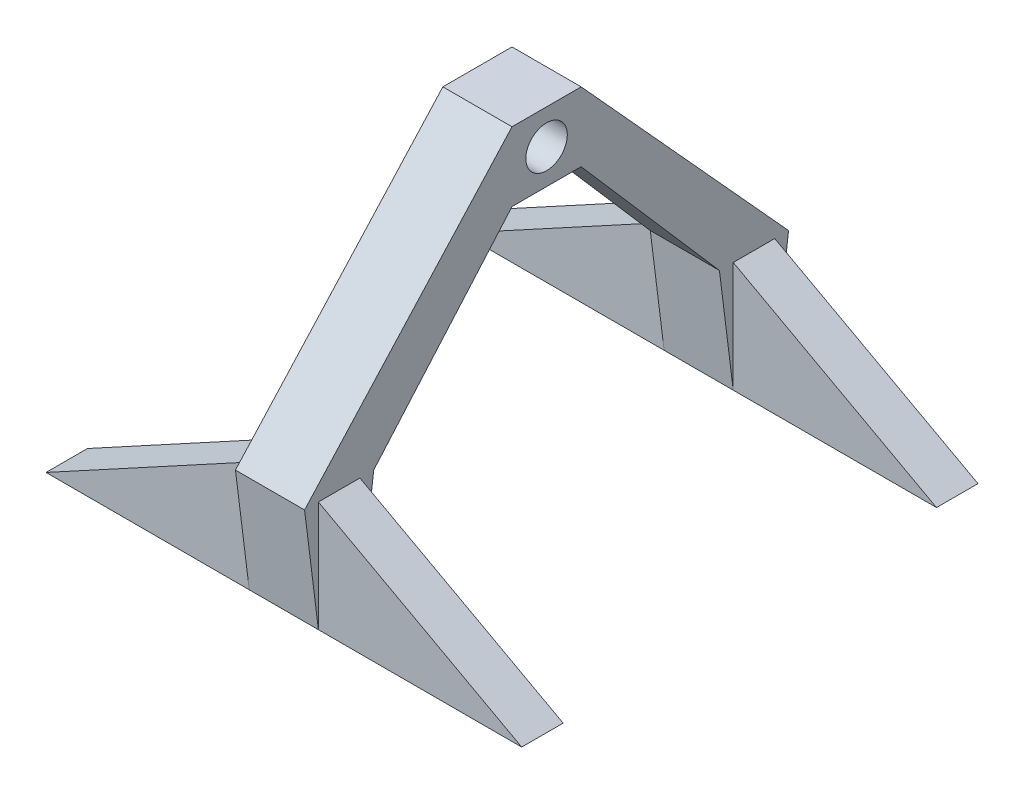
ISO-10303-21;
HEADER;
FILE_DESCRIPTION(('STEP AP214'),'2;1');
FILE_NAME('part.step','',(''),(''),'','','');
FILE_SCHEMA(('AUTOMOTIVE_DESIGN { 1 0 10303 214 1 1 1 1 }'));
ENDSEC;
DATA;
#1=APPLICATION_CONTEXT('core data for automotive mechanical design processes');
#2=APPLICATION_PROTOCOL_DEFINITION('international standard','automotive_design',2000,#1);
#3=PRODUCT_CONTEXT('',#1,'mechanical');
#4=PRODUCT('Part','Part','',(#3));
#5=PRODUCT_RELATED_PRODUCT_CATEGORY('part','',(#4));
#6=PRODUCT_DEFINITION_FORMATION('','',#4);
#7=PRODUCT_DEFINITION_CONTEXT('part definition',#1,'design');
#8=PRODUCT_DEFINITION('design','',#6,#7);
#9=PRODUCT_DEFINITION_SHAPE('','',#8);
#10=(LENGTH_UNIT() NAMED_UNIT(*) SI_UNIT(.MILLI.,.METRE.));
#11=(NAMED_UNIT(*) PLANE_ANGLE_UNIT() SI_UNIT($,.RADIAN.));
#12=(NAMED_UNIT(*) SI_UNIT($,.STERADIAN.) SOLID_ANGLE_UNIT());
#13=UNCERTAINTY_MEASURE_WITH_UNIT(LENGTH_MEASURE(1.E-05),#10,'distance_accuracy_value','');
#14=(GEOMETRIC_REPRESENTATION_CONTEXT(3) GLOBAL_UNCERTAINTY_ASSIGNED_CONTEXT((#13)) GLOBAL_UNIT_ASSIGNED_CONTEXT((#10,
#11,#12)) REPRESENTATION_CONTEXT('',''));
#15=CARTESIAN_POINT('',(0.,0.,0.));
#16=DIRECTION('',(0.,0.,1.));
#17=DIRECTION('',(1.,0.,0.));
#18=AXIS2_PLACEMENT_3D('',#15,#16,#17);
#19=CARTESIAN_POINT('',(0.,0.,0.));
#20=DIRECTION('',(0.,1.,0.));
#21=DIRECTION('',(0.,0.,1.));
#22=AXIS2_PLACEMENT_3D('',#19,#20,#21);
#23=PLANE('',#22);
#24=DIRECTION('',(-1.,0.,0.));
#25=VECTOR('',#24,1.);
#26=CARTESIAN_POINT('',(86.0010000000001,0.,7.5));
#27=LINE('',#26,#25);
#28=CARTESIAN_POINT('',(12.5000000000001,0.,7.5));
#29=VERTEX_POINT('',#28);
#30=CARTESIAN_POINT('',(-12.4999999999999,0.,7.5));
#31=VERTEX_POINT('',#30);
#32=EDGE_CURVE('E317',#29,#31,#27,.T.);
#33=ORIENTED_EDGE('',*,*,#32,.T.);
#34=DIRECTION('',(1.,0.,0.));
#35=VECTOR('',#34,1.);
#36=CARTESIAN_POINT('',(0.,0.,7.5));
#37=LINE('',#36,#35);
#38=CARTESIAN_POINT('',(-85.9999999999999,0.,7.5));
#39=VERTEX_POINT('',#38);
#40=EDGE_CURVE('E333',#39,#31,#37,.T.);
#41=ORIENTED_EDGE('',*,*,#40,.F.);
#42=DIRECTION('',(0.,0.,1.));
#43=VECTOR('',#42,1.);
#44=CARTESIAN_POINT('',(-85.9999999999999,0.,0.));
#45=LINE('',#44,#43);
#46=CARTESIAN_POINT('',(-85.9999999999999,0.,-7.5));
#47=VERTEX_POINT('',#46);
#48=EDGE_CURVE('E349',#47,#39,#45,.T.);
#49=ORIENTED_EDGE('',*,*,#48,.F.);
#50=DIRECTION('',(1.,0.,0.));
#51=VECTOR('',#50,1.);
#52=CARTESIAN_POINT('',(0.,0.,-7.5));
#53=LINE('',#52,#51);
#54=CARTESIAN_POINT('',(-12.4999999999999,0.,-7.5));
#55=VERTEX_POINT('',#54);
#56=EDGE_CURVE('E346',#47,#55,#53,.T.);
#57=ORIENTED_EDGE('',*,*,#56,.T.);
#58=DIRECTION('',(-1.,0.,0.));
#59=VECTOR('',#58,1.);
#60=CARTESIAN_POINT('',(86.0010000000001,0.,-7.5));
#61=LINE('',#60,#59);
#62=CARTESIAN_POINT('',(12.5000000000001,0.,-7.5));
#63=VERTEX_POINT('',#62);
#64=EDGE_CURVE('E326',#63,#55,#61,.T.);
#65=ORIENTED_EDGE('',*,*,#64,.F.);
#66=DIRECTION('',(1.,0.,0.));
#67=VECTOR('',#66,1.);
#68=CARTESIAN_POINT('',(0.,0.,-7.5));
#69=LINE('',#68,#67);
#70=CARTESIAN_POINT('',(85.9999999999999,0.,-7.5));
#71=VERTEX_POINT('',#70);
#72=EDGE_CURVE('E343',#63,#71,#69,.T.);
#73=ORIENTED_EDGE('',*,*,#72,.T.);
#74=DIRECTION('',(0.,0.,1.));
#75=VECTOR('',#74,1.);
#76=CARTESIAN_POINT('',(86.0000000000001,0.,0.));
#77=LINE('',#76,#75);
#78=CARTESIAN_POINT('',(86.0000000000001,0.,7.5));
#79=VERTEX_POINT('',#78);
#80=EDGE_CURVE('E339',#71,#79,#77,.T.);
#81=ORIENTED_EDGE('',*,*,#80,.T.);
#82=DIRECTION('',(1.,0.,0.));
#83=VECTOR('',#82,1.);
#84=CARTESIAN_POINT('',(0.,0.,7.5));
#85=LINE('',#84,#83);
#86=EDGE_CURVE('E336',#29,#79,#85,.T.);
#87=ORIENTED_EDGE('',*,*,#86,.F.);
#88=EDGE_LOOP('',(#33,#41,#49,#57,#65,#73,#81,#87));
#89=FACE_BOUND('',#88,.T.);
#90=ADVANCED_FACE('F35',(#89),#23,.F.);
#91=CARTESIAN_POINT('',(0.,40.,7.5));
#92=DIRECTION('',(0.,0.,-1.));
#93=DIRECTION('',(-1.,0.,0.));
#94=AXIS2_PLACEMENT_3D('',#91,#92,#93);
#95=PLANE('',#94);
#96=DIRECTION('',(-0.87835187550819,0.478014626126906,0.));
#97=VECTOR('',#96,1.);
#98=CARTESIAN_POINT('',(12.4999999999999,40.,7.5));
#99=LINE('',#98,#97);
#100=CARTESIAN_POINT('',(12.5000000000001,40.,7.5));
#101=VERTEX_POINT('',#100);
#102=EDGE_CURVE('E328',#79,#101,#99,.T.);
#103=ORIENTED_EDGE('',*,*,#102,.T.);
#104=DIRECTION('',(0.,-1.,0.));
#105=VECTOR('',#104,1.);
#106=CARTESIAN_POINT('',(12.5000000000001,40.,7.5));
#107=LINE('',#106,#105);
#108=EDGE_CURVE('E11',#101,#29,#107,.T.);
#109=ORIENTED_EDGE('',*,*,#108,.T.);
#110=ORIENTED_EDGE('',*,*,#86,.T.);
#111=EDGE_LOOP('',(#103,#109,#110));
#112=FACE_BOUND('',#111,.T.);
#113=ADVANCED_FACE('F37',(#112),#95,.F.);
#114=CARTESIAN_POINT('',(0.,40.,-7.5));
#115=DIRECTION('',(0.,0.,-1.));
#116=DIRECTION('',(-1.,0.,0.));
#117=AXIS2_PLACEMENT_3D('',#114,#115,#116);
#118=PLANE('',#117);
#119=DIRECTION('',(0.,-1.,0.));
#120=VECTOR('',#119,1.);
#121=CARTESIAN_POINT('',(12.5000000000001,40.,-7.5));
#122=LINE('',#121,#120);
#123=CARTESIAN_POINT('',(12.4999999999999,40.,-7.5));
#124=VERTEX_POINT('',#123);
#125=EDGE_CURVE('E44',#124,#63,#122,.T.);
#126=ORIENTED_EDGE('',*,*,#125,.F.);
#127=DIRECTION('',(0.87835187550819,-0.478014626126906,0.));
#128=VECTOR('',#127,1.);
#129=CARTESIAN_POINT('',(12.4999999999999,40.,-7.5));
#130=LINE('',#129,#128);
#131=EDGE_CURVE('E373',#124,#71,#130,.T.);
#132=ORIENTED_EDGE('',*,*,#131,.T.);
#133=ORIENTED_EDGE('',*,*,#72,.F.);
#134=EDGE_LOOP('',(#126,#132,#133));
#135=FACE_BOUND('',#134,.T.);
#136=ADVANCED_FACE('F425',(#135),#118,.T.);
#137=CARTESIAN_POINT('',(12.5000000000001,40.,0.));
#138=DIRECTION('',(-1.,0.,0.));
#139=DIRECTION('',(0.,0.,1.));
#140=AXIS2_PLACEMENT_3D('',#137,#138,#139);
#141=PLANE('',#140);
#142=DIRECTION('',(0.,-0.739940073395944,-0.672672793996313));
#143=VECTOR('',#142,1.);
#144=CARTESIAN_POINT('',(12.5,122.5,62.5));
#145=LINE('',#144,#143);
#146=CARTESIAN_POINT('',(12.5,122.5,62.5));
#147=VERTEX_POINT('',#146);
#148=CARTESIAN_POINT('',(12.5000000000001,40.,-12.5));
#149=VERTEX_POINT('',#148);
#150=EDGE_CURVE('E310',#147,#149,#145,.T.);
#151=ORIENTED_EDGE('',*,*,#150,.F.);
#152=DIRECTION('',(0.,0.,1.));
#153=VECTOR('',#152,1.);
#154=CARTESIAN_POINT('',(12.5,122.5,62.5));
#155=LINE('',#154,#153);
#156=CARTESIAN_POINT('',(12.5,122.5,87.5));
#157=VERTEX_POINT('',#156);
#158=EDGE_CURVE('E184',#147,#157,#155,.T.);
#159=ORIENTED_EDGE('',*,*,#158,.T.);
#160=DIRECTION('',(0.,-0.739940073395944,0.672672793996313));
#161=VECTOR('',#160,1.);
#162=CARTESIAN_POINT('',(12.5,122.5,87.5));
#163=LINE('',#162,#161);
#164=CARTESIAN_POINT('',(12.5000000000001,40.,162.5));
#165=VERTEX_POINT('',#164);
#166=EDGE_CURVE('E195',#157,#165,#163,.T.);
#167=ORIENTED_EDGE('',*,*,#166,.T.);
#168=DIRECTION('',(0.,-0.992277876713668,-0.124034734589209));
#169=VECTOR('',#168,1.);
#170=CARTESIAN_POINT('',(12.5000000000001,40.,162.5));
#171=LINE('',#170,#169);
#172=CARTESIAN_POINT('',(12.5000000000001,0.,157.5));
#173=VERTEX_POINT('',#172);
#174=EDGE_CURVE('E218',#165,#173,#171,.T.);
#175=ORIENTED_EDGE('',*,*,#174,.T.);
#176=DIRECTION('',(0.,-1.,0.));
#177=VECTOR('',#176,1.);
#178=CARTESIAN_POINT('',(12.5000000000001,40.,157.5));
#179=LINE('',#178,#177);
#180=CARTESIAN_POINT('',(12.4999999999999,40.,157.5));
#181=VERTEX_POINT('',#180);
#182=EDGE_CURVE('E269',#181,#173,#179,.T.);
#183=ORIENTED_EDGE('',*,*,#182,.F.);
#184=DIRECTION('',(0.,0.,1.));
#185=VECTOR('',#184,1.);
#186=CARTESIAN_POINT('',(12.4999999999999,40.,137.499));
#187=LINE('',#186,#185);
#188=CARTESIAN_POINT('',(12.5000000000001,40.,142.5));
#189=VERTEX_POINT('',#188);
#190=EDGE_CURVE('E265',#189,#181,#187,.T.);
#191=ORIENTED_EDGE('',*,*,#190,.F.);
#192=DIRECTION('',(0.,-1.,0.));
#193=VECTOR('',#192,1.);
#194=CARTESIAN_POINT('',(12.5000000000001,40.,142.5));
#195=LINE('',#194,#193);
#196=CARTESIAN_POINT('',(12.5000000000001,0.,142.5));
#197=VERTEX_POINT('',#196);
#198=EDGE_CURVE('E281',#189,#197,#195,.T.);
#199=ORIENTED_EDGE('',*,*,#198,.T.);
#200=DIRECTION('',(0.,-0.992277876713668,0.124034734589209));
#201=VECTOR('',#200,1.);
#202=CARTESIAN_POINT('',(12.5000000000001,40.,137.5));
#203=LINE('',#202,#201);
#204=CARTESIAN_POINT('',(12.5,40.,137.5));
#205=VERTEX_POINT('',#204);
#206=EDGE_CURVE('E201',#205,#197,#203,.T.);
#207=ORIENTED_EDGE('',*,*,#206,.F.);
#208=DIRECTION('',(0.,0.754605522163505,-0.656178714924787));
#209=VECTOR('',#208,1.);
#210=CARTESIAN_POINT('',(12.5,97.5,87.5));
#211=LINE('',#210,#209);
#212=CARTESIAN_POINT('',(12.5,97.5,87.5));
#213=VERTEX_POINT('',#212);
#214=EDGE_CURVE('E191',#205,#213,#211,.T.);
#215=ORIENTED_EDGE('',*,*,#214,.T.);
#216=DIRECTION('',(0.,0.,-1.));
#217=VECTOR('',#216,1.);
#218=CARTESIAN_POINT('',(12.5,97.5,62.5));
#219=LINE('',#218,#217);
#220=CARTESIAN_POINT('',(12.5,97.5,62.5));
#221=VERTEX_POINT('',#220);
#222=EDGE_CURVE('E173',#213,#221,#219,.T.);
#223=ORIENTED_EDGE('',*,*,#222,.T.);
#224=DIRECTION('',(0.,0.754605522163505,0.656178714924787));
#225=VECTOR('',#224,1.);
#226=CARTESIAN_POINT('',(12.5,97.5,62.5));
#227=LINE('',#226,#225);
#228=CARTESIAN_POINT('',(12.5,40.,12.5));
#229=VERTEX_POINT('',#228);
#230=EDGE_CURVE('E308',#229,#221,#227,.T.);
#231=ORIENTED_EDGE('',*,*,#230,.F.);
#232=DIRECTION('',(0.,-0.992277876713668,-0.124034734589209));
#233=VECTOR('',#232,1.);
#234=CARTESIAN_POINT('',(12.5000000000001,40.,12.5));
#235=LINE('',#234,#233);
#236=EDGE_CURVE('E319',#229,#29,#235,.T.);
#237=ORIENTED_EDGE('',*,*,#236,.T.);
#238=ORIENTED_EDGE('',*,*,#108,.F.);
#239=DIRECTION('',(0.,0.,-1.));
#240=VECTOR('',#239,1.);
#241=CARTESIAN_POINT('',(12.4999999999999,40.,12.501));
#242=LINE('',#241,#240);
#243=EDGE_CURVE('E366',#101,#124,#242,.T.);
#244=ORIENTED_EDGE('',*,*,#243,.T.);
#245=ORIENTED_EDGE('',*,*,#125,.T.);
#246=DIRECTION('',(0.,-0.992277876713668,0.124034734589209));
#247=VECTOR('',#246,1.);
#248=CARTESIAN_POINT('',(12.5000000000001,40.,-12.5));
#249=LINE('',#248,#247);
#250=EDGE_CURVE('E322',#149,#63,#249,.T.);
#251=ORIENTED_EDGE('',*,*,#250,.F.);
#252=EDGE_LOOP('',(#151,#159,#167,#175,#183,#191,#199,#207,#215,#223,#231,#237,#238,#244,#245,#251));
#253=FACE_BOUND('',#252,.T.);
#254=CARTESIAN_POINT('',(12.5,110.,75.));
#255=DIRECTION('',(1.,0.,0.));
#256=DIRECTION('',(0.,0.,-1.));
#257=AXIS2_PLACEMENT_3D('',#254,#255,#256);
#258=CIRCLE('',#257,7.50000000000001);
#259=CARTESIAN_POINT('',(12.5,110.,67.5));
#260=VERTEX_POINT('',#259);
#261=EDGE_CURVE('E185',#260,#260,#258,.T.);
#262=ORIENTED_EDGE('',*,*,#261,.F.);
#263=EDGE_LOOP('',(#262));
#264=FACE_BOUND('',#263,.T.);
#265=ADVANCED_FACE('F198',(#253,#264),#141,.F.);
#266=CARTESIAN_POINT('',(-12.4999999999999,40.,0.));
#267=DIRECTION('',(-1.,0.,0.));
#268=DIRECTION('',(0.,0.,1.));
#269=AXIS2_PLACEMENT_3D('',#266,#267,#268);
#270=PLANE('',#269);
#271=DIRECTION('',(0.,-0.754605522163505,-0.656178714924787));
#272=VECTOR('',#271,1.);
#273=CARTESIAN_POINT('',(-12.5,97.5,62.5));
#274=LINE('',#273,#272);
#275=CARTESIAN_POINT('',(-12.5,97.5,62.5));
#276=VERTEX_POINT('',#275);
#277=CARTESIAN_POINT('',(-12.4999999999999,40.,12.5));
#278=VERTEX_POINT('',#277);
#279=EDGE_CURVE('E302',#276,#278,#274,.T.);
#280=ORIENTED_EDGE('',*,*,#279,.F.);
#281=DIRECTION('',(0.,0.,-1.));
#282=VECTOR('',#281,1.);
#283=CARTESIAN_POINT('',(-12.5,97.5,62.5));
#284=LINE('',#283,#282);
#285=CARTESIAN_POINT('',(-12.5,97.5,87.5));
#286=VERTEX_POINT('',#285);
#287=EDGE_CURVE('E298',#286,#276,#284,.T.);
#288=ORIENTED_EDGE('',*,*,#287,.F.);
#289=DIRECTION('',(0.,-0.754605522163505,0.656178714924787));
#290=VECTOR('',#289,1.);
#291=CARTESIAN_POINT('',(-12.5,97.5,87.5));
#292=LINE('',#291,#290);
#293=CARTESIAN_POINT('',(-12.4999999999999,40.,137.5));
#294=VERTEX_POINT('',#293);
#295=EDGE_CURVE('E194',#286,#294,#292,.T.);
#296=ORIENTED_EDGE('',*,*,#295,.T.);
#297=DIRECTION('',(0.,0.992277876713668,-0.124034734589209));
#298=VECTOR('',#297,1.);
#299=CARTESIAN_POINT('',(-12.4999999999999,40.,137.5));
#300=LINE('',#299,#298);
#301=CARTESIAN_POINT('',(-12.4999999999999,0.,142.5));
#302=VERTEX_POINT('',#301);
#303=EDGE_CURVE('E202',#302,#294,#300,.T.);
#304=ORIENTED_EDGE('',*,*,#303,.F.);
#305=DIRECTION('',(0.,-1.,0.));
#306=VECTOR('',#305,1.);
#307=CARTESIAN_POINT('',(-12.4999999999999,40.,142.5));
#308=LINE('',#307,#306);
#309=CARTESIAN_POINT('',(-12.4999999999999,40.,142.5));
#310=VERTEX_POINT('',#309);
#311=EDGE_CURVE('E232',#310,#302,#308,.T.);
#312=ORIENTED_EDGE('',*,*,#311,.F.);
#313=DIRECTION('',(0.,0.,1.));
#314=VECTOR('',#313,1.);
#315=CARTESIAN_POINT('',(-12.4999999999999,40.,137.499));
#316=LINE('',#315,#314);
#317=CARTESIAN_POINT('',(-12.4999999999999,40.,157.5));
#318=VERTEX_POINT('',#317);
#319=EDGE_CURVE('E252',#310,#318,#316,.T.);
#320=ORIENTED_EDGE('',*,*,#319,.T.);
#321=DIRECTION('',(0.,-1.,0.));
#322=VECTOR('',#321,1.);
#323=CARTESIAN_POINT('',(-12.4999999999999,40.,157.5));
#324=LINE('',#323,#322);
#325=CARTESIAN_POINT('',(-12.4999999999999,0.,157.5));
#326=VERTEX_POINT('',#325);
#327=EDGE_CURVE('E261',#318,#326,#324,.T.);
#328=ORIENTED_EDGE('',*,*,#327,.T.);
#329=DIRECTION('',(0.,0.992277876713668,0.124034734589209));
#330=VECTOR('',#329,1.);
#331=CARTESIAN_POINT('',(-12.4999999999999,40.,162.5));
#332=LINE('',#331,#330);
#333=CARTESIAN_POINT('',(-12.4999999999999,40.,162.5));
#334=VERTEX_POINT('',#333);
#335=EDGE_CURVE('E220',#326,#334,#332,.T.);
#336=ORIENTED_EDGE('',*,*,#335,.T.);
#337=DIRECTION('',(0.,0.739940073395944,-0.672672793996313));
#338=VECTOR('',#337,1.);
#339=CARTESIAN_POINT('',(-12.5,122.5,87.5));
#340=LINE('',#339,#338);
#341=CARTESIAN_POINT('',(-12.5,122.5,87.5));
#342=VERTEX_POINT('',#341);
#343=EDGE_CURVE('E211',#334,#342,#340,.T.);
#344=ORIENTED_EDGE('',*,*,#343,.T.);
#345=DIRECTION('',(0.,0.,1.));
#346=VECTOR('',#345,1.);
#347=CARTESIAN_POINT('',(-12.5,122.5,62.5));
#348=LINE('',#347,#346);
#349=CARTESIAN_POINT('',(-12.5,122.5,62.5));
#350=VERTEX_POINT('',#349);
#351=EDGE_CURVE('E300',#350,#342,#348,.T.);
#352=ORIENTED_EDGE('',*,*,#351,.F.);
#353=DIRECTION('',(0.,0.739940073395944,0.672672793996313));
#354=VECTOR('',#353,1.);
#355=CARTESIAN_POINT('',(-12.5,122.5,62.5));
#356=LINE('',#355,#354);
#357=CARTESIAN_POINT('',(-12.4999999999999,40.,-12.5));
#358=VERTEX_POINT('',#357);
#359=EDGE_CURVE('E305',#358,#350,#356,.T.);
#360=ORIENTED_EDGE('',*,*,#359,.F.);
#361=DIRECTION('',(0.,0.992277876713668,-0.124034734589209));
#362=VECTOR('',#361,1.);
#363=CARTESIAN_POINT('',(-12.4999999999999,40.,-12.5));
#364=LINE('',#363,#362);
#365=EDGE_CURVE('E324',#55,#358,#364,.T.);
#366=ORIENTED_EDGE('',*,*,#365,.F.);
#367=DIRECTION('',(0.,-1.,0.));
#368=VECTOR('',#367,1.);
#369=CARTESIAN_POINT('',(-12.4999999999999,40.,-7.5));
#370=LINE('',#369,#368);
#371=CARTESIAN_POINT('',(-12.4999999999999,40.,-7.5));
#372=VERTEX_POINT('',#371);
#373=EDGE_CURVE('E362',#372,#55,#370,.T.);
#374=ORIENTED_EDGE('',*,*,#373,.F.);
#375=DIRECTION('',(0.,0.,-1.));
#376=VECTOR('',#375,1.);
#377=CARTESIAN_POINT('',(-12.4999999999999,40.,12.501));
#378=LINE('',#377,#376);
#379=CARTESIAN_POINT('',(-12.4999999999999,40.,7.5));
#380=VERTEX_POINT('',#379);
#381=EDGE_CURVE('E354',#380,#372,#378,.T.);
#382=ORIENTED_EDGE('',*,*,#381,.F.);
#383=DIRECTION('',(0.,-1.,0.));
#384=VECTOR('',#383,1.);
#385=CARTESIAN_POINT('',(-12.4999999999999,40.,7.5));
#386=LINE('',#385,#384);
#387=EDGE_CURVE('E335',#380,#31,#386,.T.);
#388=ORIENTED_EDGE('',*,*,#387,.T.);
#389=DIRECTION('',(0.,0.992277876713668,0.124034734589209));
#390=VECTOR('',#389,1.);
#391=CARTESIAN_POINT('',(-12.4999999999999,40.,12.5));
#392=LINE('',#391,#390);
#393=EDGE_CURVE('E51',#31,#278,#392,.T.);
#394=ORIENTED_EDGE('',*,*,#393,.T.);
#395=EDGE_LOOP('',(#280,#288,#296,#304,#312,#320,#328,#336,#344,#352,#360,#366,#374,#382,#388,#394));
#396=FACE_BOUND('',#395,.T.);
#397=CARTESIAN_POINT('',(-12.5,110.,75.));
#398=DIRECTION('',(1.,0.,0.));
#399=DIRECTION('',(0.,0.,-1.));
#400=AXIS2_PLACEMENT_3D('',#397,#398,#399);
#401=CIRCLE('',#400,7.50000000000001);
#402=CARTESIAN_POINT('',(-12.5,110.,67.5));
#403=VERTEX_POINT('',#402);
#404=EDGE_CURVE('E295',#403,#403,#401,.T.);
#405=ORIENTED_EDGE('',*,*,#404,.T.);
#406=EDGE_LOOP('',(#405));
#407=FACE_BOUND('',#406,.T.);
#408=ADVANCED_FACE('F399',(#396,#407),#270,.T.);
#409=CARTESIAN_POINT('',(0.,40.,-7.5));
#410=DIRECTION('',(0.,0.,-1.));
#411=DIRECTION('',(-1.,0.,0.));
#412=AXIS2_PLACEMENT_3D('',#409,#410,#411);
#413=PLANE('',#412);
#414=DIRECTION('',(-0.87835187550819,-0.478014626126906,0.));
#415=VECTOR('',#414,1.);
#416=CARTESIAN_POINT('',(-12.4999999999999,40.,-7.5));
#417=LINE('',#416,#415);
#418=EDGE_CURVE('E59',#372,#47,#417,.T.);
#419=ORIENTED_EDGE('',*,*,#418,.F.);
#420=ORIENTED_EDGE('',*,*,#373,.T.);
#421=ORIENTED_EDGE('',*,*,#56,.F.);
#422=EDGE_LOOP('',(#419,#420,#421));
#423=FACE_BOUND('',#422,.T.);
#424=ADVANCED_FACE('F409',(#423),#413,.T.);
#425=CARTESIAN_POINT('',(0.,40.,7.5));
#426=DIRECTION('',(0.,0.,-1.));
#427=DIRECTION('',(-1.,0.,0.));
#428=AXIS2_PLACEMENT_3D('',#425,#426,#427);
#429=PLANE('',#428);
#430=ORIENTED_EDGE('',*,*,#387,.F.);
#431=DIRECTION('',(0.87835187550819,0.478014626126906,0.));
#432=VECTOR('',#431,1.);
#433=CARTESIAN_POINT('',(-12.4999999999999,40.,7.5));
#434=LINE('',#433,#432);
#435=EDGE_CURVE('E340',#39,#380,#434,.T.);
#436=ORIENTED_EDGE('',*,*,#435,.F.);
#437=ORIENTED_EDGE('',*,*,#40,.T.);
#438=EDGE_LOOP('',(#430,#436,#437));
#439=FACE_BOUND('',#438,.T.);
#440=ADVANCED_FACE('F404',(#439),#429,.F.);
#441=CARTESIAN_POINT('',(-12.4999999999999,40.,12.501));
#442=DIRECTION('',(0.478014626126906,-0.878351875508189,0.));
#443=DIRECTION('',(0.87835187550819,0.478014626126906,0.));
#444=AXIS2_PLACEMENT_3D('',#441,#442,#443);
#445=PLANE('',#444);
#446=ORIENTED_EDGE('',*,*,#435,.T.);
#447=ORIENTED_EDGE('',*,*,#381,.T.);
#448=ORIENTED_EDGE('',*,*,#418,.T.);
#449=ORIENTED_EDGE('',*,*,#48,.T.);
#450=EDGE_LOOP('',(#446,#447,#448,#449));
#451=FACE_BOUND('',#450,.T.);
#452=ADVANCED_FACE('F405',(#451),#445,.F.);
#453=CARTESIAN_POINT('',(12.4999999999999,40.,12.501));
#454=DIRECTION('',(0.478014626126906,0.878351875508189,0.));
#455=DIRECTION('',(-0.87835187550819,0.478014626126906,0.));
#456=AXIS2_PLACEMENT_3D('',#453,#454,#455);
#457=PLANE('',#456);
#458=ORIENTED_EDGE('',*,*,#80,.F.);
#459=ORIENTED_EDGE('',*,*,#131,.F.);
#460=ORIENTED_EDGE('',*,*,#243,.F.);
#461=ORIENTED_EDGE('',*,*,#102,.F.);
#462=EDGE_LOOP('',(#458,#459,#460,#461));
#463=FACE_BOUND('',#462,.T.);
#464=ADVANCED_FACE('F426',(#463),#457,.T.);
#465=CARTESIAN_POINT('',(86.0010000000001,40.,-12.5));
#466=DIRECTION('',(0.,0.124034734589209,0.992277876713668));
#467=DIRECTION('',(0.,-0.992277876713668,0.124034734589209));
#468=AXIS2_PLACEMENT_3D('',#465,#466,#467);
#469=PLANE('',#468);
#470=ORIENTED_EDGE('',*,*,#250,.T.);
#471=ORIENTED_EDGE('',*,*,#64,.T.);
#472=ORIENTED_EDGE('',*,*,#365,.T.);
#473=DIRECTION('',(1.,0.,0.));
#474=VECTOR('',#473,1.);
#475=CARTESIAN_POINT('',(0.,40.,-12.5));
#476=LINE('',#475,#474);
#477=EDGE_CURVE('E332',#358,#149,#476,.T.);
#478=ORIENTED_EDGE('',*,*,#477,.T.);
#479=EDGE_LOOP('',(#470,#471,#472,#478));
#480=FACE_BOUND('',#479,.T.);
#481=ADVANCED_FACE('F415',(#480),#469,.F.);
#482=CARTESIAN_POINT('',(86.0010000000001,40.,12.5));
#483=DIRECTION('',(0.,-0.124034734589209,0.992277876713668));
#484=DIRECTION('',(0.,-0.992277876713668,-0.124034734589209));
#485=AXIS2_PLACEMENT_3D('',#482,#483,#484);
#486=PLANE('',#485);
#487=DIRECTION('',(1.,0.,0.));
#488=VECTOR('',#487,1.);
#489=CARTESIAN_POINT('',(0.,40.,12.5));
#490=LINE('',#489,#488);
#491=EDGE_CURVE('E329',#278,#229,#490,.T.);
#492=ORIENTED_EDGE('',*,*,#491,.F.);
#493=ORIENTED_EDGE('',*,*,#393,.F.);
#494=ORIENTED_EDGE('',*,*,#32,.F.);
#495=ORIENTED_EDGE('',*,*,#236,.F.);
#496=EDGE_LOOP('',(#492,#493,#494,#495));
#497=FACE_BOUND('',#496,.T.);
#498=ADVANCED_FACE('F393',(#497),#486,.T.);
#499=CARTESIAN_POINT('',(123.995515604889,122.5,62.5));
#500=DIRECTION('',(0.,-0.672672793996313,0.739940073395944));
#501=DIRECTION('',(0.,-0.739940073395944,-0.672672793996313));
#502=AXIS2_PLACEMENT_3D('',#499,#500,#501);
#503=PLANE('',#502);
#504=DIRECTION('',(-1.,0.,0.));
#505=VECTOR('',#504,1.);
#506=CARTESIAN_POINT('',(123.995515604889,122.5,62.5));
#507=LINE('',#506,#505);
#508=EDGE_CURVE('E307',#147,#350,#507,.T.);
#509=ORIENTED_EDGE('',*,*,#508,.F.);
#510=ORIENTED_EDGE('',*,*,#150,.T.);
#511=ORIENTED_EDGE('',*,*,#477,.F.);
#512=ORIENTED_EDGE('',*,*,#359,.T.);
#513=EDGE_LOOP('',(#509,#510,#511,#512));
#514=FACE_BOUND('',#513,.T.);
#515=ADVANCED_FACE('F419',(#514),#503,.F.);
#516=CARTESIAN_POINT('',(123.995515604889,97.5,62.5));
#517=DIRECTION('',(0.,0.656178714924787,-0.754605522163505));
#518=DIRECTION('',(0.,0.754605522163505,0.656178714924787));
#519=AXIS2_PLACEMENT_3D('',#516,#517,#518);
#520=PLANE('',#519);
#521=ORIENTED_EDGE('',*,*,#491,.T.);
#522=ORIENTED_EDGE('',*,*,#230,.T.);
#523=DIRECTION('',(-1.,0.,0.));
#524=VECTOR('',#523,1.);
#525=CARTESIAN_POINT('',(123.995515604889,97.5,62.5));
#526=LINE('',#525,#524);
#527=EDGE_CURVE('E180',#221,#276,#526,.T.);
#528=ORIENTED_EDGE('',*,*,#527,.T.);
#529=ORIENTED_EDGE('',*,*,#279,.T.);
#530=EDGE_LOOP('',(#521,#522,#528,#529));
#531=FACE_BOUND('',#530,.T.);
#532=ADVANCED_FACE('F520',(#531),#520,.F.);
#533=CARTESIAN_POINT('',(-12.5,122.5,62.5));
#534=DIRECTION('',(0.,1.,0.));
#535=DIRECTION('',(0.,0.,1.));
#536=AXIS2_PLACEMENT_3D('',#533,#534,#535);
#537=PLANE('',#536);
#538=DIRECTION('',(-1.,0.,0.));
#539=VECTOR('',#538,1.);
#540=CARTESIAN_POINT('',(123.995515604889,122.5,87.5));
#541=LINE('',#540,#539);
#542=EDGE_CURVE('E196',#157,#342,#541,.T.);
#543=ORIENTED_EDGE('',*,*,#542,.F.);
#544=ORIENTED_EDGE('',*,*,#158,.F.);
#545=ORIENTED_EDGE('',*,*,#508,.T.);
#546=ORIENTED_EDGE('',*,*,#351,.T.);
#547=EDGE_LOOP('',(#543,#544,#545,#546));
#548=FACE_BOUND('',#547,.T.);
#549=ADVANCED_FACE('F527',(#548),#537,.T.);
#550=CARTESIAN_POINT('',(-12.5,97.5,62.5));
#551=DIRECTION('',(0.,-1.,0.));
#552=DIRECTION('',(0.,0.,-1.));
#553=AXIS2_PLACEMENT_3D('',#550,#551,#552);
#554=PLANE('',#553);
#555=ORIENTED_EDGE('',*,*,#527,.F.);
#556=ORIENTED_EDGE('',*,*,#222,.F.);
#557=DIRECTION('',(-1.,0.,0.));
#558=VECTOR('',#557,1.);
#559=CARTESIAN_POINT('',(123.995515604889,97.5,87.5));
#560=LINE('',#559,#558);
#561=EDGE_CURVE('E177',#213,#286,#560,.T.);
#562=ORIENTED_EDGE('',*,*,#561,.T.);
#563=ORIENTED_EDGE('',*,*,#287,.T.);
#564=EDGE_LOOP('',(#555,#556,#562,#563));
#565=FACE_BOUND('',#564,.T.);
#566=ADVANCED_FACE('F175',(#565),#554,.T.);
#567=CARTESIAN_POINT('',(-12.5,110.,75.));
#568=DIRECTION('',(1.,0.,0.));
#569=DIRECTION('',(0.,0.,-1.));
#570=AXIS2_PLACEMENT_3D('',#567,#568,#569);
#571=CYLINDRICAL_SURFACE('',#570,7.50000000000001);
#572=ORIENTED_EDGE('',*,*,#404,.F.);
#573=EDGE_LOOP('',(#572));
#574=FACE_BOUND('',#573,.T.);
#575=ORIENTED_EDGE('',*,*,#261,.T.);
#576=EDGE_LOOP('',(#575));
#577=FACE_BOUND('',#576,.T.);
#578=ADVANCED_FACE('F533',(#574,#577),#571,.F.);
#579=CARTESIAN_POINT('',(0.,0.,150.));
#580=DIRECTION('',(0.,1.,0.));
#581=DIRECTION('',(0.,0.,-1.));
#582=AXIS2_PLACEMENT_3D('',#579,#580,#581);
#583=PLANE('',#582);
#584=DIRECTION('',(-1.,0.,0.));
#585=VECTOR('',#584,1.);
#586=CARTESIAN_POINT('',(86.0010000000001,0.,142.5));
#587=LINE('',#586,#585);
#588=EDGE_CURVE('E205',#197,#302,#587,.T.);
#589=ORIENTED_EDGE('',*,*,#588,.F.);
#590=DIRECTION('',(1.,0.,0.));
#591=VECTOR('',#590,1.);
#592=CARTESIAN_POINT('',(0.,0.,142.5));
#593=LINE('',#592,#591);
#594=CARTESIAN_POINT('',(86.0000000000001,0.,142.5));
#595=VERTEX_POINT('',#594);
#596=EDGE_CURVE('E233',#197,#595,#593,.T.);
#597=ORIENTED_EDGE('',*,*,#596,.T.);
#598=DIRECTION('',(0.,0.,-1.));
#599=VECTOR('',#598,1.);
#600=CARTESIAN_POINT('',(86.0000000000001,0.,150.));
#601=LINE('',#600,#599);
#602=CARTESIAN_POINT('',(85.9999999999999,0.,157.5));
#603=VERTEX_POINT('',#602);
#604=EDGE_CURVE('E236',#603,#595,#601,.T.);
#605=ORIENTED_EDGE('',*,*,#604,.F.);
#606=DIRECTION('',(1.,0.,0.));
#607=VECTOR('',#606,1.);
#608=CARTESIAN_POINT('',(0.,0.,157.5));
#609=LINE('',#608,#607);
#610=EDGE_CURVE('E240',#173,#603,#609,.T.);
#611=ORIENTED_EDGE('',*,*,#610,.F.);
#612=DIRECTION('',(-1.,0.,0.));
#613=VECTOR('',#612,1.);
#614=CARTESIAN_POINT('',(86.0010000000001,0.,157.5));
#615=LINE('',#614,#613);
#616=EDGE_CURVE('E223',#173,#326,#615,.T.);
#617=ORIENTED_EDGE('',*,*,#616,.T.);
#618=DIRECTION('',(1.,0.,0.));
#619=VECTOR('',#618,1.);
#620=CARTESIAN_POINT('',(0.,0.,157.5));
#621=LINE('',#620,#619);
#622=CARTESIAN_POINT('',(-85.9999999999999,0.,157.5));
#623=VERTEX_POINT('',#622);
#624=EDGE_CURVE('E243',#623,#326,#621,.T.);
#625=ORIENTED_EDGE('',*,*,#624,.F.);
#626=DIRECTION('',(0.,0.,-1.));
#627=VECTOR('',#626,1.);
#628=CARTESIAN_POINT('',(-85.9999999999999,0.,150.));
#629=LINE('',#628,#627);
#630=CARTESIAN_POINT('',(-85.9999999999999,0.,142.5));
#631=VERTEX_POINT('',#630);
#632=EDGE_CURVE('E246',#623,#631,#629,.T.);
#633=ORIENTED_EDGE('',*,*,#632,.T.);
#634=DIRECTION('',(1.,0.,0.));
#635=VECTOR('',#634,1.);
#636=CARTESIAN_POINT('',(0.,0.,142.5));
#637=LINE('',#636,#635);
#638=EDGE_CURVE('E230',#631,#302,#637,.T.);
#639=ORIENTED_EDGE('',*,*,#638,.T.);
#640=EDGE_LOOP('',(#589,#597,#605,#611,#617,#625,#633,#639));
#641=FACE_BOUND('',#640,.T.);
#642=ADVANCED_FACE('F537',(#641),#583,.F.);
#643=CARTESIAN_POINT('',(0.,40.,142.5));
#644=DIRECTION('',(0.,0.,1.));
#645=DIRECTION('',(-1.,0.,0.));
#646=AXIS2_PLACEMENT_3D('',#643,#644,#645);
#647=PLANE('',#646);
#648=DIRECTION('',(-0.87835187550819,0.478014626126906,0.));
#649=VECTOR('',#648,1.);
#650=CARTESIAN_POINT('',(12.4999999999999,40.,142.5));
#651=LINE('',#650,#649);
#652=EDGE_CURVE('E226',#595,#189,#651,.T.);
#653=ORIENTED_EDGE('',*,*,#652,.F.);
#654=ORIENTED_EDGE('',*,*,#596,.F.);
#655=ORIENTED_EDGE('',*,*,#198,.F.);
#656=EDGE_LOOP('',(#653,#654,#655));
#657=FACE_BOUND('',#656,.T.);
#658=ADVANCED_FACE('F583',(#657),#647,.F.);
#659=CARTESIAN_POINT('',(0.,40.,157.5));
#660=DIRECTION('',(0.,0.,1.));
#661=DIRECTION('',(-1.,0.,0.));
#662=AXIS2_PLACEMENT_3D('',#659,#660,#661);
#663=PLANE('',#662);
#664=ORIENTED_EDGE('',*,*,#182,.T.);
#665=ORIENTED_EDGE('',*,*,#610,.T.);
#666=DIRECTION('',(0.87835187550819,-0.478014626126906,0.));
#667=VECTOR('',#666,1.);
#668=CARTESIAN_POINT('',(12.4999999999999,40.,157.5));
#669=LINE('',#668,#667);
#670=EDGE_CURVE('E272',#181,#603,#669,.T.);
#671=ORIENTED_EDGE('',*,*,#670,.F.);
#672=EDGE_LOOP('',(#664,#665,#671));
#673=FACE_BOUND('',#672,.T.);
#674=ADVANCED_FACE('F602',(#673),#663,.T.);
#675=CARTESIAN_POINT('',(0.,40.,157.5));
#676=DIRECTION('',(0.,0.,1.));
#677=DIRECTION('',(-1.,0.,0.));
#678=AXIS2_PLACEMENT_3D('',#675,#676,#677);
#679=PLANE('',#678);
#680=DIRECTION('',(-0.87835187550819,-0.478014626126906,0.));
#681=VECTOR('',#680,1.);
#682=CARTESIAN_POINT('',(-12.4999999999999,40.,157.5));
#683=LINE('',#682,#681);
#684=EDGE_CURVE('E257',#318,#623,#683,.T.);
#685=ORIENTED_EDGE('',*,*,#684,.T.);
#686=ORIENTED_EDGE('',*,*,#624,.T.);
#687=ORIENTED_EDGE('',*,*,#327,.F.);
#688=EDGE_LOOP('',(#685,#686,#687));
#689=FACE_BOUND('',#688,.T.);
#690=ADVANCED_FACE('F611',(#689),#679,.T.);
#691=CARTESIAN_POINT('',(0.,40.,142.5));
#692=DIRECTION('',(0.,0.,1.));
#693=DIRECTION('',(-1.,0.,0.));
#694=AXIS2_PLACEMENT_3D('',#691,#692,#693);
#695=PLANE('',#694);
#696=ORIENTED_EDGE('',*,*,#311,.T.);
#697=ORIENTED_EDGE('',*,*,#638,.F.);
#698=DIRECTION('',(0.87835187550819,0.478014626126906,0.));
#699=VECTOR('',#698,1.);
#700=CARTESIAN_POINT('',(-12.4999999999999,40.,142.5));
#701=LINE('',#700,#699);
#702=EDGE_CURVE('E237',#631,#310,#701,.T.);
#703=ORIENTED_EDGE('',*,*,#702,.T.);
#704=EDGE_LOOP('',(#696,#697,#703));
#705=FACE_BOUND('',#704,.T.);
#706=ADVANCED_FACE('F620',(#705),#695,.F.);
#707=CARTESIAN_POINT('',(-12.4999999999999,40.,137.499));
#708=DIRECTION('',(0.478014626126906,-0.878351875508189,0.));
#709=DIRECTION('',(0.87835187550819,0.478014626126906,0.));
#710=AXIS2_PLACEMENT_3D('',#707,#708,#709);
#711=PLANE('',#710);
#712=ORIENTED_EDGE('',*,*,#702,.F.);
#713=ORIENTED_EDGE('',*,*,#632,.F.);
#714=ORIENTED_EDGE('',*,*,#684,.F.);
#715=ORIENTED_EDGE('',*,*,#319,.F.);
#716=EDGE_LOOP('',(#712,#713,#714,#715));
#717=FACE_BOUND('',#716,.T.);
#718=ADVANCED_FACE('F629',(#717),#711,.F.);
#719=CARTESIAN_POINT('',(12.4999999999999,40.,137.499));
#720=DIRECTION('',(0.478014626126906,0.878351875508189,0.));
#721=DIRECTION('',(-0.87835187550819,0.478014626126906,0.));
#722=AXIS2_PLACEMENT_3D('',#719,#720,#721);
#723=PLANE('',#722);
#724=ORIENTED_EDGE('',*,*,#604,.T.);
#725=ORIENTED_EDGE('',*,*,#652,.T.);
#726=ORIENTED_EDGE('',*,*,#190,.T.);
#727=ORIENTED_EDGE('',*,*,#670,.T.);
#728=EDGE_LOOP('',(#724,#725,#726,#727));
#729=FACE_BOUND('',#728,.T.);
#730=ADVANCED_FACE('F638',(#729),#723,.T.);
#731=CARTESIAN_POINT('',(86.0010000000001,40.,162.5));
#732=DIRECTION('',(0.,0.124034734589209,-0.992277876713668));
#733=DIRECTION('',(0.,-0.992277876713668,-0.124034734589209));
#734=AXIS2_PLACEMENT_3D('',#731,#732,#733);
#735=PLANE('',#734);
#736=ORIENTED_EDGE('',*,*,#174,.F.);
#737=DIRECTION('',(1.,0.,0.));
#738=VECTOR('',#737,1.);
#739=CARTESIAN_POINT('',(0.,40.,162.5));
#740=LINE('',#739,#738);
#741=EDGE_CURVE('E229',#334,#165,#740,.T.);
#742=ORIENTED_EDGE('',*,*,#741,.F.);
#743=ORIENTED_EDGE('',*,*,#335,.F.);
#744=ORIENTED_EDGE('',*,*,#616,.F.);
#745=EDGE_LOOP('',(#736,#742,#743,#744));
#746=FACE_BOUND('',#745,.T.);
#747=ADVANCED_FACE('F647',(#746),#735,.F.);
#748=CARTESIAN_POINT('',(86.0010000000001,40.,137.5));
#749=DIRECTION('',(0.,-0.124034734589209,-0.992277876713668));
#750=DIRECTION('',(0.,-0.992277876713668,0.124034734589209));
#751=AXIS2_PLACEMENT_3D('',#748,#749,#750);
#752=PLANE('',#751);
#753=DIRECTION('',(1.,0.,0.));
#754=VECTOR('',#753,1.);
#755=CARTESIAN_POINT('',(0.,40.,137.5));
#756=LINE('',#755,#754);
#757=EDGE_CURVE('E227',#294,#205,#756,.T.);
#758=ORIENTED_EDGE('',*,*,#757,.T.);
#759=ORIENTED_EDGE('',*,*,#206,.T.);
#760=ORIENTED_EDGE('',*,*,#588,.T.);
#761=ORIENTED_EDGE('',*,*,#303,.T.);
#762=EDGE_LOOP('',(#758,#759,#760,#761));
#763=FACE_BOUND('',#762,.T.);
#764=ADVANCED_FACE('F656',(#763),#752,.T.);
#765=CARTESIAN_POINT('',(123.995515604889,122.5,87.5));
#766=DIRECTION('',(0.,-0.672672793996313,-0.739940073395944));
#767=DIRECTION('',(0.,-0.739940073395944,0.672672793996313));
#768=AXIS2_PLACEMENT_3D('',#765,#766,#767);
#769=PLANE('',#768);
#770=ORIENTED_EDGE('',*,*,#542,.T.);
#771=ORIENTED_EDGE('',*,*,#343,.F.);
#772=ORIENTED_EDGE('',*,*,#741,.T.);
#773=ORIENTED_EDGE('',*,*,#166,.F.);
#774=EDGE_LOOP('',(#770,#771,#772,#773));
#775=FACE_BOUND('',#774,.T.);
#776=ADVANCED_FACE('F665',(#775),#769,.F.);
#777=CARTESIAN_POINT('',(123.995515604889,97.5,87.5));
#778=DIRECTION('',(0.,0.656178714924787,0.754605522163505));
#779=DIRECTION('',(0.,0.754605522163505,-0.656178714924787));
#780=AXIS2_PLACEMENT_3D('',#777,#778,#779);
#781=PLANE('',#780);
#782=ORIENTED_EDGE('',*,*,#757,.F.);
#783=ORIENTED_EDGE('',*,*,#295,.F.);
#784=ORIENTED_EDGE('',*,*,#561,.F.);
#785=ORIENTED_EDGE('',*,*,#214,.F.);
#786=EDGE_LOOP('',(#782,#783,#784,#785));
#787=FACE_BOUND('',#786,.T.);
#788=ADVANCED_FACE('F190',(#787),#781,.F.);
#789=CLOSED_SHELL('',(#90,#113,#136,#265,#408,#424,#440,#452,#464,#481,#498,#515,#532,#549,#566,
#578,#642,#658,#674,#690,#706,#718,#730,#747,#764,#776,#788));
#790=MANIFOLD_SOLID_BREP('B2',#789);
#791=ADVANCED_BREP_SHAPE_REPRESENTATION('',(#18,#790),#14);
#792=SHAPE_DEFINITION_REPRESENTATION(#9,#791);
ENDSEC;
END-ISO-10303-21;
